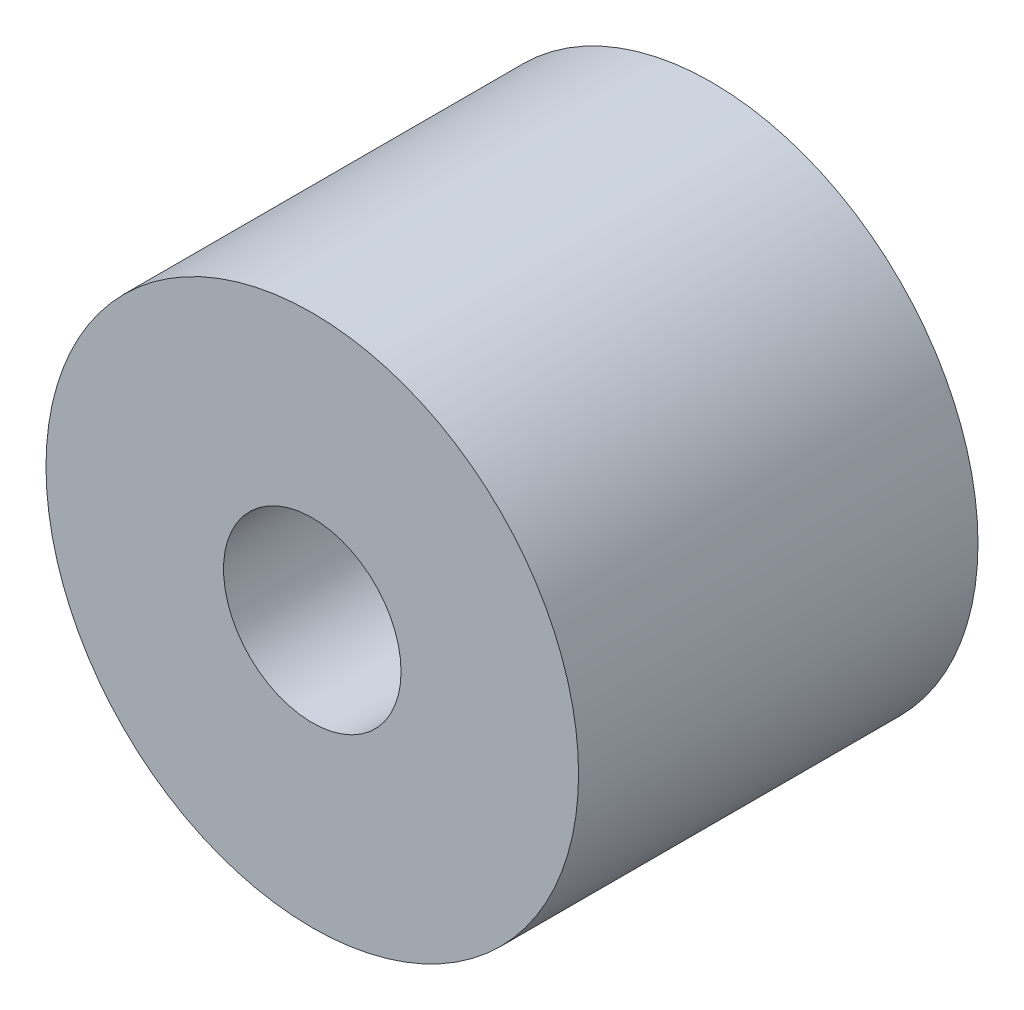
ISO-10303-21;
HEADER;
FILE_DESCRIPTION(('STEP AP214'),'2;1');
FILE_NAME('part.step','',(''),(''),'','','');
FILE_SCHEMA(('AUTOMOTIVE_DESIGN { 1 0 10303 214 1 1 1 1 }'));
ENDSEC;
DATA;
#1=APPLICATION_CONTEXT('core data for automotive mechanical design processes');
#2=APPLICATION_PROTOCOL_DEFINITION('international standard','automotive_design',2000,#1);
#3=PRODUCT_CONTEXT('',#1,'mechanical');
#4=PRODUCT('Part','Part','',(#3));
#5=PRODUCT_RELATED_PRODUCT_CATEGORY('part','',(#4));
#6=PRODUCT_DEFINITION_FORMATION('','',#4);
#7=PRODUCT_DEFINITION_CONTEXT('part definition',#1,'design');
#8=PRODUCT_DEFINITION('design','',#6,#7);
#9=PRODUCT_DEFINITION_SHAPE('','',#8);
#10=(LENGTH_UNIT() NAMED_UNIT(*) SI_UNIT(.MILLI.,.METRE.));
#11=(NAMED_UNIT(*) PLANE_ANGLE_UNIT() SI_UNIT($,.RADIAN.));
#12=(NAMED_UNIT(*) SI_UNIT($,.STERADIAN.) SOLID_ANGLE_UNIT());
#13=UNCERTAINTY_MEASURE_WITH_UNIT(LENGTH_MEASURE(1.E-05),#10,'distance_accuracy_value','');
#14=(GEOMETRIC_REPRESENTATION_CONTEXT(3) GLOBAL_UNCERTAINTY_ASSIGNED_CONTEXT((#13)) GLOBAL_UNIT_ASSIGNED_CONTEXT((#10,
#11,#12)) REPRESENTATION_CONTEXT('',''));
#15=CARTESIAN_POINT('',(0.,0.,0.));
#16=DIRECTION('',(0.,0.,1.));
#17=DIRECTION('',(1.,0.,0.));
#18=AXIS2_PLACEMENT_3D('',#15,#16,#17);
#19=CARTESIAN_POINT('',(0.,0.,18.));
#20=DIRECTION('',(0.,0.,1.));
#21=DIRECTION('',(1.,0.,0.));
#22=AXIS2_PLACEMENT_3D('',#19,#20,#21);
#23=PLANE('',#22);
#24=CARTESIAN_POINT('',(0.,0.,18.));
#25=DIRECTION('',(0.,0.,1.));
#26=DIRECTION('',(1.,0.,0.));
#27=AXIS2_PLACEMENT_3D('',#24,#25,#26);
#28=CIRCLE('',#27,12.);
#29=CARTESIAN_POINT('',(12.,0.,18.));
#30=VERTEX_POINT('',#29);
#31=EDGE_CURVE('E10',#30,#30,#28,.T.);
#32=ORIENTED_EDGE('',*,*,#31,.T.);
#33=EDGE_LOOP('',(#32));
#34=FACE_BOUND('',#33,.T.);
#35=CARTESIAN_POINT('',(0.,0.,18.));
#36=DIRECTION('',(0.,0.,1.));
#37=DIRECTION('',(1.,0.,0.));
#38=AXIS2_PLACEMENT_3D('',#35,#36,#37);
#39=CIRCLE('',#38,4.);
#40=CARTESIAN_POINT('',(4.,0.,18.));
#41=VERTEX_POINT('',#40);
#42=EDGE_CURVE('E45',#41,#41,#39,.T.);
#43=ORIENTED_EDGE('',*,*,#42,.F.);
#44=EDGE_LOOP('',(#43));
#45=FACE_BOUND('',#44,.T.);
#46=ADVANCED_FACE('F34',(#34,#45),#23,.T.);
#47=CARTESIAN_POINT('',(0.,0.,0.));
#48=DIRECTION('',(0.,0.,1.));
#49=DIRECTION('',(1.,0.,0.));
#50=AXIS2_PLACEMENT_3D('',#47,#48,#49);
#51=PLANE('',#50);
#52=CARTESIAN_POINT('',(0.,0.,0.));
#53=DIRECTION('',(0.,0.,1.));
#54=DIRECTION('',(1.,0.,0.));
#55=AXIS2_PLACEMENT_3D('',#52,#53,#54);
#56=CIRCLE('',#55,12.);
#57=CARTESIAN_POINT('',(12.,0.,0.));
#58=VERTEX_POINT('',#57);
#59=EDGE_CURVE('E38',#58,#58,#56,.T.);
#60=ORIENTED_EDGE('',*,*,#59,.F.);
#61=EDGE_LOOP('',(#60));
#62=FACE_BOUND('',#61,.T.);
#63=CARTESIAN_POINT('',(0.,0.,0.));
#64=DIRECTION('',(0.,0.,1.));
#65=DIRECTION('',(1.,0.,0.));
#66=AXIS2_PLACEMENT_3D('',#63,#64,#65);
#67=CIRCLE('',#66,4.);
#68=CARTESIAN_POINT('',(4.,0.,0.));
#69=VERTEX_POINT('',#68);
#70=EDGE_CURVE('E47',#69,#69,#67,.T.);
#71=ORIENTED_EDGE('',*,*,#70,.T.);
#72=EDGE_LOOP('',(#71));
#73=FACE_BOUND('',#72,.T.);
#74=ADVANCED_FACE('F57',(#62,#73),#51,.F.);
#75=CARTESIAN_POINT('',(0.,0.,18.));
#76=DIRECTION('',(0.,0.,-1.));
#77=DIRECTION('',(-1.,0.,0.));
#78=AXIS2_PLACEMENT_3D('',#75,#76,#77);
#79=CYLINDRICAL_SURFACE('',#78,12.);
#80=ORIENTED_EDGE('',*,*,#31,.F.);
#81=EDGE_LOOP('',(#80));
#82=FACE_BOUND('',#81,.T.);
#83=ORIENTED_EDGE('',*,*,#59,.T.);
#84=EDGE_LOOP('',(#83));
#85=FACE_BOUND('',#84,.T.);
#86=ADVANCED_FACE('F36',(#82,#85),#79,.T.);
#87=CARTESIAN_POINT('',(0.,0.,18.));
#88=DIRECTION('',(0.,0.,-1.));
#89=DIRECTION('',(-1.,0.,0.));
#90=AXIS2_PLACEMENT_3D('',#87,#88,#89);
#91=CYLINDRICAL_SURFACE('',#90,4.);
#92=ORIENTED_EDGE('',*,*,#42,.T.);
#93=EDGE_LOOP('',(#92));
#94=FACE_BOUND('',#93,.T.);
#95=ORIENTED_EDGE('',*,*,#70,.F.);
#96=EDGE_LOOP('',(#95));
#97=FACE_BOUND('',#96,.T.);
#98=ADVANCED_FACE('F53',(#94,#97),#91,.F.);
#99=CLOSED_SHELL('',(#46,#74,#86,#98));
#100=MANIFOLD_SOLID_BREP('B2',#99);
#101=ADVANCED_BREP_SHAPE_REPRESENTATION('',(#18,#100),#14);
#102=SHAPE_DEFINITION_REPRESENTATION(#9,#101);
ENDSEC;
END-ISO-10303-21;
